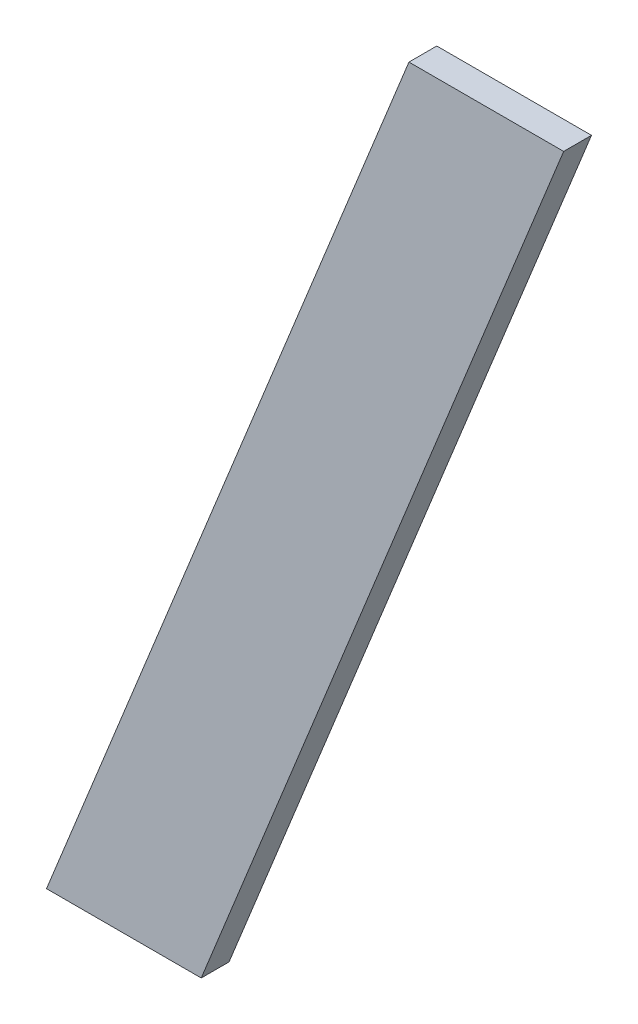
ISO-10303-21;
HEADER;
FILE_DESCRIPTION(('STEP AP214'),'2;1');
FILE_NAME('part.step','',(''),(''),'','','');
FILE_SCHEMA(('AUTOMOTIVE_DESIGN { 1 0 10303 214 1 1 1 1 }'));
ENDSEC;
DATA;
#1=APPLICATION_CONTEXT('core data for automotive mechanical design processes');
#2=APPLICATION_PROTOCOL_DEFINITION('international standard','automotive_design',2000,#1);
#3=PRODUCT_CONTEXT('',#1,'mechanical');
#4=PRODUCT('Part','Part','',(#3));
#5=PRODUCT_RELATED_PRODUCT_CATEGORY('part','',(#4));
#6=PRODUCT_DEFINITION_FORMATION('','',#4);
#7=PRODUCT_DEFINITION_CONTEXT('part definition',#1,'design');
#8=PRODUCT_DEFINITION('design','',#6,#7);
#9=PRODUCT_DEFINITION_SHAPE('','',#8);
#10=(LENGTH_UNIT() NAMED_UNIT(*) SI_UNIT(.MILLI.,.METRE.));
#11=(NAMED_UNIT(*) PLANE_ANGLE_UNIT() SI_UNIT($,.RADIAN.));
#12=(NAMED_UNIT(*) SI_UNIT($,.STERADIAN.) SOLID_ANGLE_UNIT());
#13=UNCERTAINTY_MEASURE_WITH_UNIT(LENGTH_MEASURE(1.E-05),#10,'distance_accuracy_value','');
#14=(GEOMETRIC_REPRESENTATION_CONTEXT(3) GLOBAL_UNCERTAINTY_ASSIGNED_CONTEXT((#13)) GLOBAL_UNIT_ASSIGNED_CONTEXT((#10,
#11,#12)) REPRESENTATION_CONTEXT('',''));
#15=CARTESIAN_POINT('',(0.,0.,0.));
#16=DIRECTION('',(0.,0.,1.));
#17=DIRECTION('',(1.,0.,0.));
#18=AXIS2_PLACEMENT_3D('',#15,#16,#17);
#19=CARTESIAN_POINT('',(-0.0430938097883339,-0.56437912510646,0.));
#20=DIRECTION('',(0.,-1.,0.));
#21=DIRECTION('',(1.,0.,0.));
#22=AXIS2_PLACEMENT_3D('',#19,#20,#21);
#23=PLANE('',#22);
#24=DIRECTION('',(1.,0.,0.));
#25=VECTOR('',#24,1.);
#26=CARTESIAN_POINT('',(-0.0430938097883339,-0.56437912510646,0.));
#27=LINE('',#26,#25);
#28=CARTESIAN_POINT('',(-0.0430938097883339,-0.56437912510646,0.));
#29=VERTEX_POINT('',#28);
#30=CARTESIAN_POINT('',(-0.0264168097883339,-0.56437912510646,0.));
#31=VERTEX_POINT('',#30);
#32=EDGE_CURVE('E11',#29,#31,#27,.T.);
#33=ORIENTED_EDGE('',*,*,#32,.T.);
#34=DIRECTION('',(0.,0.,1.));
#35=VECTOR('',#34,1.);
#36=CARTESIAN_POINT('',(-0.0264168097883339,-0.56437912510646,0.));
#37=LINE('',#36,#35);
#38=CARTESIAN_POINT('',(-0.0264168097883339,-0.56437912510646,0.003));
#39=VERTEX_POINT('',#38);
#40=EDGE_CURVE('E24',#31,#39,#37,.T.);
#41=ORIENTED_EDGE('',*,*,#40,.T.);
#42=DIRECTION('',(1.,0.,0.));
#43=VECTOR('',#42,1.);
#44=CARTESIAN_POINT('',(-0.0430938097883339,-0.56437912510646,0.003));
#45=LINE('',#44,#43);
#46=CARTESIAN_POINT('',(-0.0430938097883339,-0.56437912510646,0.003));
#47=VERTEX_POINT('',#46);
#48=EDGE_CURVE('E75',#47,#39,#45,.T.);
#49=ORIENTED_EDGE('',*,*,#48,.F.);
#50=DIRECTION('',(0.,0.,1.));
#51=VECTOR('',#50,1.);
#52=CARTESIAN_POINT('',(-0.0430938097883339,-0.56437912510646,0.));
#53=LINE('',#52,#51);
#54=EDGE_CURVE('E86',#29,#47,#53,.T.);
#55=ORIENTED_EDGE('',*,*,#54,.F.);
#56=EDGE_LOOP('',(#33,#41,#49,#55));
#57=FACE_BOUND('',#56,.T.);
#58=ADVANCED_FACE('F17',(#57),#23,.T.);
#59=CARTESIAN_POINT('',(-0.00402608985498388,-0.467683125106459,0.));
#60=DIRECTION('',(-0.927183854566809,0.374606593415859,0.));
#61=DIRECTION('',(-0.374606593415859,-0.927183854566809,0.));
#62=AXIS2_PLACEMENT_3D('',#59,#60,#61);
#63=PLANE('',#62);
#64=DIRECTION('',(-0.374606593415859,-0.927183854566809,0.));
#65=VECTOR('',#64,1.);
#66=CARTESIAN_POINT('',(-0.00402608985498388,-0.467683125106459,0.));
#67=LINE('',#66,#65);
#68=CARTESIAN_POINT('',(-0.00402608985498388,-0.467683125106459,0.));
#69=VERTEX_POINT('',#68);
#70=EDGE_CURVE('E83',#69,#29,#67,.T.);
#71=ORIENTED_EDGE('',*,*,#70,.T.);
#72=ORIENTED_EDGE('',*,*,#54,.T.);
#73=DIRECTION('',(-0.374606593415859,-0.927183854566809,0.));
#74=VECTOR('',#73,1.);
#75=CARTESIAN_POINT('',(-0.00402608985498388,-0.467683125106459,0.003));
#76=LINE('',#75,#74);
#77=CARTESIAN_POINT('',(-0.00402608985498388,-0.467683125106459,0.003));
#78=VERTEX_POINT('',#77);
#79=EDGE_CURVE('E81',#78,#47,#76,.T.);
#80=ORIENTED_EDGE('',*,*,#79,.F.);
#81=DIRECTION('',(0.,0.,1.));
#82=VECTOR('',#81,1.);
#83=CARTESIAN_POINT('',(-0.00402608985498388,-0.467683125106459,0.));
#84=LINE('',#83,#82);
#85=EDGE_CURVE('E61',#69,#78,#84,.T.);
#86=ORIENTED_EDGE('',*,*,#85,.F.);
#87=EDGE_LOOP('',(#71,#72,#80,#86));
#88=FACE_BOUND('',#87,.T.);
#89=ADVANCED_FACE('F91',(#88),#63,.T.);
#90=CARTESIAN_POINT('',(0.0126509101450161,-0.467683125106459,0.));
#91=DIRECTION('',(0.,1.,0.));
#92=DIRECTION('',(-1.,0.,0.));
#93=AXIS2_PLACEMENT_3D('',#90,#91,#92);
#94=PLANE('',#93);
#95=DIRECTION('',(-1.,0.,0.));
#96=VECTOR('',#95,1.);
#97=CARTESIAN_POINT('',(0.0126509101450161,-0.467683125106459,0.));
#98=LINE('',#97,#96);
#99=CARTESIAN_POINT('',(0.0126509101450161,-0.467683125106459,0.));
#100=VERTEX_POINT('',#99);
#101=EDGE_CURVE('E65',#100,#69,#98,.T.);
#102=ORIENTED_EDGE('',*,*,#101,.T.);
#103=ORIENTED_EDGE('',*,*,#85,.T.);
#104=DIRECTION('',(-1.,0.,0.));
#105=VECTOR('',#104,1.);
#106=CARTESIAN_POINT('',(0.0126509101450161,-0.467683125106459,0.003));
#107=LINE('',#106,#105);
#108=CARTESIAN_POINT('',(0.0126509101450161,-0.467683125106459,0.003));
#109=VERTEX_POINT('',#108);
#110=EDGE_CURVE('E54',#109,#78,#107,.T.);
#111=ORIENTED_EDGE('',*,*,#110,.F.);
#112=DIRECTION('',(0.,0.,1.));
#113=VECTOR('',#112,1.);
#114=CARTESIAN_POINT('',(0.0126509101450161,-0.467683125106459,0.));
#115=LINE('',#114,#113);
#116=EDGE_CURVE('E58',#100,#109,#115,.T.);
#117=ORIENTED_EDGE('',*,*,#116,.F.);
#118=EDGE_LOOP('',(#102,#103,#111,#117));
#119=FACE_BOUND('',#118,.T.);
#120=ADVANCED_FACE('F57',(#119),#94,.T.);
#121=CARTESIAN_POINT('',(-0.0264168097883339,-0.56437912510646,0.));
#122=DIRECTION('',(0.927183854566809,-0.374606593415859,0.));
#123=DIRECTION('',(0.374606593415859,0.927183854566809,0.));
#124=AXIS2_PLACEMENT_3D('',#121,#122,#123);
#125=PLANE('',#124);
#126=DIRECTION('',(0.374606593415859,0.927183854566809,0.));
#127=VECTOR('',#126,1.);
#128=CARTESIAN_POINT('',(-0.0264168097883339,-0.56437912510646,0.));
#129=LINE('',#128,#127);
#130=EDGE_CURVE('E71',#31,#100,#129,.T.);
#131=ORIENTED_EDGE('',*,*,#130,.T.);
#132=ORIENTED_EDGE('',*,*,#116,.T.);
#133=DIRECTION('',(0.374606593415859,0.927183854566809,0.));
#134=VECTOR('',#133,1.);
#135=CARTESIAN_POINT('',(-0.0264168097883339,-0.56437912510646,0.003));
#136=LINE('',#135,#134);
#137=EDGE_CURVE('E70',#39,#109,#136,.T.);
#138=ORIENTED_EDGE('',*,*,#137,.F.);
#139=ORIENTED_EDGE('',*,*,#40,.F.);
#140=EDGE_LOOP('',(#131,#132,#138,#139));
#141=FACE_BOUND('',#140,.T.);
#142=ADVANCED_FACE('F69',(#141),#125,.T.);
#143=CARTESIAN_POINT('',(-0.0152214498216589,-0.51603112510646,0.003));
#144=DIRECTION('',(0.,0.,1.));
#145=DIRECTION('',(1.,0.,0.));
#146=AXIS2_PLACEMENT_3D('',#143,#144,#145);
#147=PLANE('',#146);
#148=ORIENTED_EDGE('',*,*,#137,.T.);
#149=ORIENTED_EDGE('',*,*,#110,.T.);
#150=ORIENTED_EDGE('',*,*,#79,.T.);
#151=ORIENTED_EDGE('',*,*,#48,.T.);
#152=EDGE_LOOP('',(#148,#149,#150,#151));
#153=FACE_BOUND('',#152,.T.);
#154=ADVANCED_FACE('F74',(#153),#147,.T.);
#155=CARTESIAN_POINT('',(-0.0152214498216589,-0.51603112510646,0.));
#156=DIRECTION('',(0.,0.,1.));
#157=DIRECTION('',(1.,0.,0.));
#158=AXIS2_PLACEMENT_3D('',#155,#156,#157);
#159=PLANE('',#158);
#160=ORIENTED_EDGE('',*,*,#130,.F.);
#161=ORIENTED_EDGE('',*,*,#32,.F.);
#162=ORIENTED_EDGE('',*,*,#70,.F.);
#163=ORIENTED_EDGE('',*,*,#101,.F.);
#164=EDGE_LOOP('',(#160,#161,#162,#163));
#165=FACE_BOUND('',#164,.T.);
#166=ADVANCED_FACE('F89',(#165),#159,.F.);
#167=CLOSED_SHELL('',(#58,#89,#120,#142,#154,#166));
#168=MANIFOLD_SOLID_BREP('B1',#167);
#169=ADVANCED_BREP_SHAPE_REPRESENTATION('',(#18,#168),#14);
#170=SHAPE_DEFINITION_REPRESENTATION(#9,#169);
ENDSEC;
END-ISO-10303-21;
